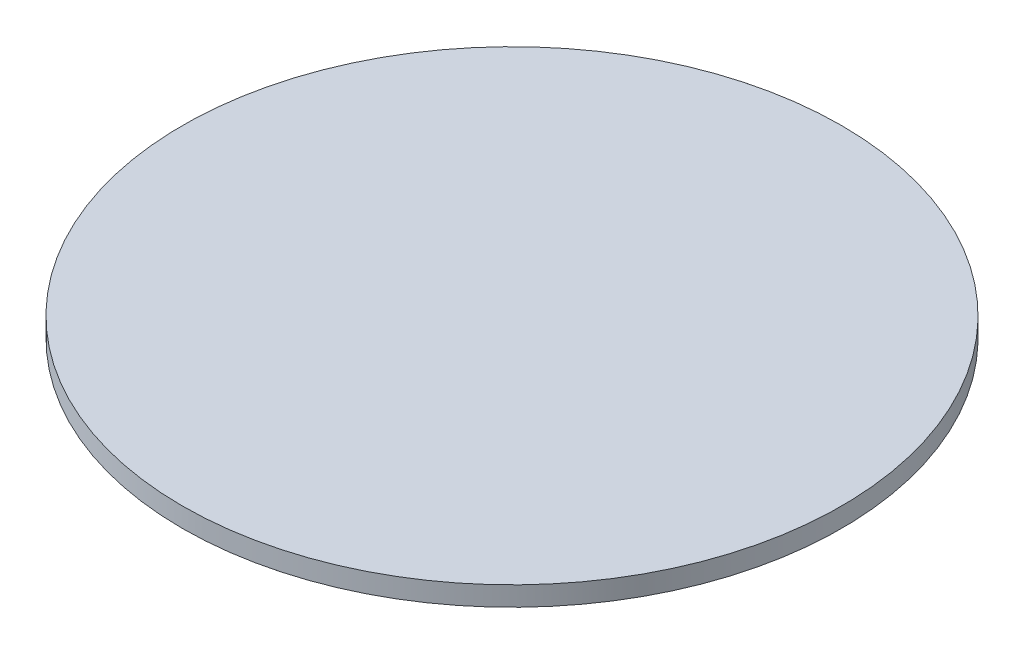
ISO-10303-21;
HEADER;
FILE_DESCRIPTION(('STEP AP214'),'2;1');
FILE_NAME('part.step','',(''),(''),'','','');
FILE_SCHEMA(('AUTOMOTIVE_DESIGN { 1 0 10303 214 1 1 1 1 }'));
ENDSEC;
DATA;
#1=APPLICATION_CONTEXT('core data for automotive mechanical design processes');
#2=APPLICATION_PROTOCOL_DEFINITION('international standard','automotive_design',2000,#1);
#3=PRODUCT_CONTEXT('',#1,'mechanical');
#4=PRODUCT('Part','Part','',(#3));
#5=PRODUCT_RELATED_PRODUCT_CATEGORY('part','',(#4));
#6=PRODUCT_DEFINITION_FORMATION('','',#4);
#7=PRODUCT_DEFINITION_CONTEXT('part definition',#1,'design');
#8=PRODUCT_DEFINITION('design','',#6,#7);
#9=PRODUCT_DEFINITION_SHAPE('','',#8);
#10=(LENGTH_UNIT() NAMED_UNIT(*) SI_UNIT(.MILLI.,.METRE.));
#11=(NAMED_UNIT(*) PLANE_ANGLE_UNIT() SI_UNIT($,.RADIAN.));
#12=(NAMED_UNIT(*) SI_UNIT($,.STERADIAN.) SOLID_ANGLE_UNIT());
#13=UNCERTAINTY_MEASURE_WITH_UNIT(LENGTH_MEASURE(1.E-05),#10,'distance_accuracy_value','');
#14=(GEOMETRIC_REPRESENTATION_CONTEXT(3) GLOBAL_UNCERTAINTY_ASSIGNED_CONTEXT((#13)) GLOBAL_UNIT_ASSIGNED_CONTEXT((#10,
#11,#12)) REPRESENTATION_CONTEXT('',''));
#15=CARTESIAN_POINT('',(0.,0.,0.));
#16=DIRECTION('',(0.,0.,1.));
#17=DIRECTION('',(1.,0.,0.));
#18=AXIS2_PLACEMENT_3D('',#15,#16,#17);
#19=CARTESIAN_POINT('',(0.,1.5,0.));
#20=DIRECTION('',(0.,-1.,0.));
#21=DIRECTION('',(0.,0.,-1.));
#22=AXIS2_PLACEMENT_3D('',#19,#20,#21);
#23=CYLINDRICAL_SURFACE('',#22,25.4);
#24=CARTESIAN_POINT('',(0.,1.5,0.));
#25=DIRECTION('',(0.,1.,0.));
#26=DIRECTION('',(0.,0.,1.));
#27=AXIS2_PLACEMENT_3D('',#24,#25,#26);
#28=CIRCLE('',#27,25.4);
#29=CARTESIAN_POINT('',(0.,1.5,25.4));
#30=VERTEX_POINT('',#29);
#31=EDGE_CURVE('E10',#30,#30,#28,.T.);
#32=ORIENTED_EDGE('',*,*,#31,.F.);
#33=EDGE_LOOP('',(#32));
#34=FACE_BOUND('',#33,.T.);
#35=CARTESIAN_POINT('',(0.,0.,0.));
#36=DIRECTION('',(0.,1.,0.));
#37=DIRECTION('',(0.,0.,1.));
#38=AXIS2_PLACEMENT_3D('',#35,#36,#37);
#39=CIRCLE('',#38,25.4);
#40=CARTESIAN_POINT('',(0.,0.,25.4));
#41=VERTEX_POINT('',#40);
#42=EDGE_CURVE('E36',#41,#41,#39,.T.);
#43=ORIENTED_EDGE('',*,*,#42,.T.);
#44=EDGE_LOOP('',(#43));
#45=FACE_BOUND('',#44,.T.);
#46=ADVANCED_FACE('F33',(#34,#45),#23,.T.);
#47=CARTESIAN_POINT('',(0.,1.5,0.));
#48=DIRECTION('',(0.,1.,0.));
#49=DIRECTION('',(0.,0.,1.));
#50=AXIS2_PLACEMENT_3D('',#47,#48,#49);
#51=PLANE('',#50);
#52=ORIENTED_EDGE('',*,*,#31,.T.);
#53=EDGE_LOOP('',(#52));
#54=FACE_BOUND('',#53,.T.);
#55=ADVANCED_FACE('F48',(#54),#51,.T.);
#56=CARTESIAN_POINT('',(0.,0.,0.));
#57=DIRECTION('',(0.,1.,0.));
#58=DIRECTION('',(0.,0.,1.));
#59=AXIS2_PLACEMENT_3D('',#56,#57,#58);
#60=PLANE('',#59);
#61=ORIENTED_EDGE('',*,*,#42,.F.);
#62=EDGE_LOOP('',(#61));
#63=FACE_BOUND('',#62,.T.);
#64=ADVANCED_FACE('F46',(#63),#60,.F.);
#65=CLOSED_SHELL('',(#46,#55,#64));
#66=MANIFOLD_SOLID_BREP('B2',#65);
#67=ADVANCED_BREP_SHAPE_REPRESENTATION('',(#18,#66),#14);
#68=SHAPE_DEFINITION_REPRESENTATION(#9,#67);
ENDSEC;
END-ISO-10303-21;
